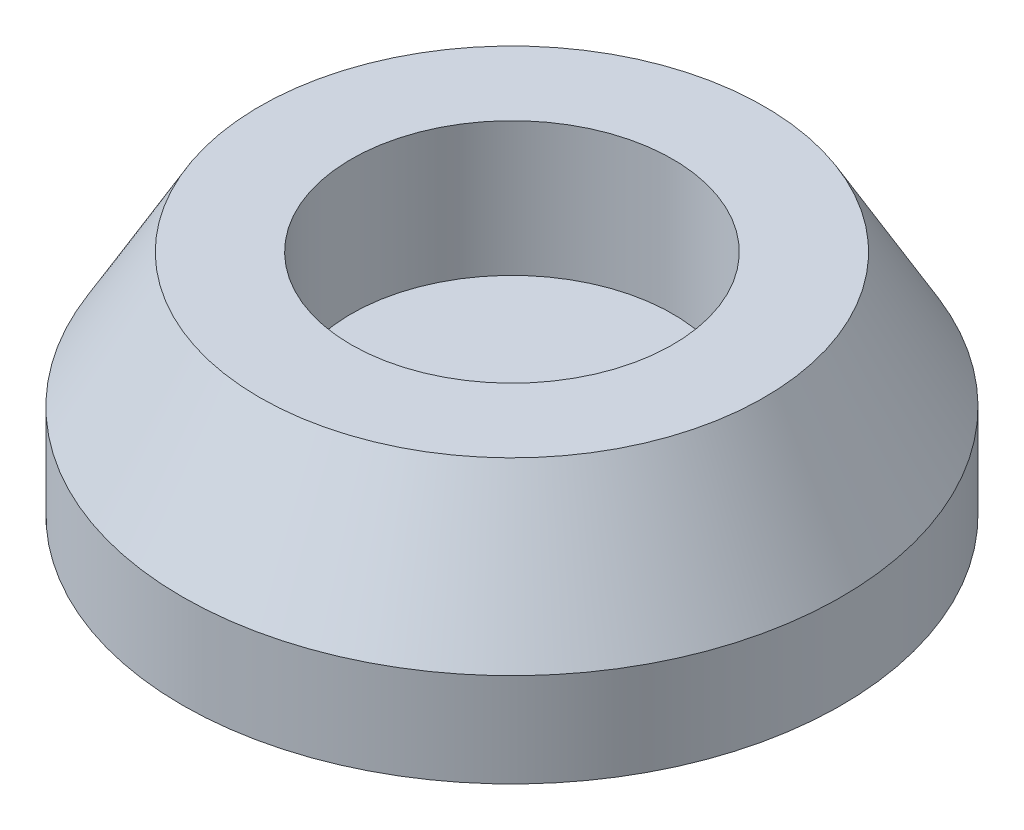
ISO-10303-21;
HEADER;
FILE_DESCRIPTION(('STEP AP214'),'2;1');
FILE_NAME('part.step','',(''),(''),'','','');
FILE_SCHEMA(('AUTOMOTIVE_DESIGN { 1 0 10303 214 1 1 1 1 }'));
ENDSEC;
DATA;
#1=APPLICATION_CONTEXT('core data for automotive mechanical design processes');
#2=APPLICATION_PROTOCOL_DEFINITION('international standard','automotive_design',2000,#1);
#3=PRODUCT_CONTEXT('',#1,'mechanical');
#4=PRODUCT('Part','Part','',(#3));
#5=PRODUCT_RELATED_PRODUCT_CATEGORY('part','',(#4));
#6=PRODUCT_DEFINITION_FORMATION('','',#4);
#7=PRODUCT_DEFINITION_CONTEXT('part definition',#1,'design');
#8=PRODUCT_DEFINITION('design','',#6,#7);
#9=PRODUCT_DEFINITION_SHAPE('','',#8);
#10=(LENGTH_UNIT() NAMED_UNIT(*) SI_UNIT(.MILLI.,.METRE.));
#11=(NAMED_UNIT(*) PLANE_ANGLE_UNIT() SI_UNIT($,.RADIAN.));
#12=(NAMED_UNIT(*) SI_UNIT($,.STERADIAN.) SOLID_ANGLE_UNIT());
#13=UNCERTAINTY_MEASURE_WITH_UNIT(LENGTH_MEASURE(1.E-05),#10,'distance_accuracy_value','');
#14=(GEOMETRIC_REPRESENTATION_CONTEXT(3) GLOBAL_UNCERTAINTY_ASSIGNED_CONTEXT((#13)) GLOBAL_UNIT_ASSIGNED_CONTEXT((#10,
#11,#12)) REPRESENTATION_CONTEXT('',''));
#15=CARTESIAN_POINT('',(0.,0.,0.));
#16=DIRECTION('',(0.,0.,1.));
#17=DIRECTION('',(1.,0.,0.));
#18=AXIS2_PLACEMENT_3D('',#15,#16,#17);
#19=CARTESIAN_POINT('',(0.,3.5,0.));
#20=DIRECTION('',(0.,-1.,0.));
#21=DIRECTION('',(0.,0.,-1.));
#22=AXIS2_PLACEMENT_3D('',#19,#20,#21);
#23=CYLINDRICAL_SURFACE('',#22,12.3);
#24=CARTESIAN_POINT('',(0.,3.49999999999998,0.));
#25=DIRECTION('',(0.,1.,0.));
#26=DIRECTION('',(0.,0.,1.));
#27=AXIS2_PLACEMENT_3D('',#24,#25,#26);
#28=CIRCLE('',#27,12.3);
#29=CARTESIAN_POINT('',(0.,3.49999999999998,12.3));
#30=VERTEX_POINT('',#29);
#31=EDGE_CURVE('E10',#30,#30,#28,.F.);
#32=ORIENTED_EDGE('',*,*,#31,.T.);
#33=EDGE_LOOP('',(#32));
#34=FACE_BOUND('',#33,.T.);
#35=CARTESIAN_POINT('',(0.,0.,0.));
#36=DIRECTION('',(0.,1.,0.));
#37=DIRECTION('',(0.,0.,1.));
#38=AXIS2_PLACEMENT_3D('',#35,#36,#37);
#39=CIRCLE('',#38,12.3);
#40=CARTESIAN_POINT('',(0.,0.,12.3));
#41=VERTEX_POINT('',#40);
#42=EDGE_CURVE('E49',#41,#41,#39,.T.);
#43=ORIENTED_EDGE('',*,*,#42,.T.);
#44=EDGE_LOOP('',(#43));
#45=FACE_BOUND('',#44,.T.);
#46=ADVANCED_FACE('F33',(#34,#45),#23,.T.);
#47=CARTESIAN_POINT('',(0.,0.,0.));
#48=DIRECTION('',(0.,1.,0.));
#49=DIRECTION('',(0.,0.,1.));
#50=AXIS2_PLACEMENT_3D('',#47,#48,#49);
#51=PLANE('',#50);
#52=ORIENTED_EDGE('',*,*,#42,.F.);
#53=EDGE_LOOP('',(#52));
#54=FACE_BOUND('',#53,.T.);
#55=ADVANCED_FACE('F63',(#54),#51,.F.);
#56=CARTESIAN_POINT('',(0.,8.5,0.));
#57=DIRECTION('',(0.,1.,0.));
#58=DIRECTION('',(0.,0.,1.));
#59=AXIS2_PLACEMENT_3D('',#56,#57,#58);
#60=PLANE('',#59);
#61=CARTESIAN_POINT('',(0.,8.5,0.));
#62=DIRECTION('',(0.,1.,0.));
#63=DIRECTION('',(0.,0.,1.));
#64=AXIS2_PLACEMENT_3D('',#61,#62,#63);
#65=CIRCLE('',#64,9.41324865405187);
#66=CARTESIAN_POINT('',(0.,8.5,9.41324865405187));
#67=VERTEX_POINT('',#66);
#68=EDGE_CURVE('E41',#67,#67,#65,.T.);
#69=ORIENTED_EDGE('',*,*,#68,.T.);
#70=EDGE_LOOP('',(#69));
#71=FACE_BOUND('',#70,.T.);
#72=CARTESIAN_POINT('',(0.,8.5,0.));
#73=DIRECTION('',(0.,1.,0.));
#74=DIRECTION('',(0.,0.,1.));
#75=AXIS2_PLACEMENT_3D('',#72,#73,#74);
#76=CIRCLE('',#75,6.);
#77=CARTESIAN_POINT('',(0.,8.5,6.));
#78=VERTEX_POINT('',#77);
#79=EDGE_CURVE('E54',#78,#78,#76,.T.);
#80=ORIENTED_EDGE('',*,*,#79,.F.);
#81=EDGE_LOOP('',(#80));
#82=FACE_BOUND('',#81,.T.);
#83=ADVANCED_FACE('F61',(#71,#82),#60,.T.);
#84=CARTESIAN_POINT('',(0.,8.5,0.));
#85=DIRECTION('',(0.,-1.,0.));
#86=DIRECTION('',(0.,0.,-1.));
#87=AXIS2_PLACEMENT_3D('',#84,#85,#86);
#88=CYLINDRICAL_SURFACE('',#87,6.);
#89=ORIENTED_EDGE('',*,*,#79,.T.);
#90=EDGE_LOOP('',(#89));
#91=FACE_BOUND('',#90,.T.);
#92=CARTESIAN_POINT('',(0.,3.5,0.));
#93=DIRECTION('',(0.,1.,0.));
#94=DIRECTION('',(0.,0.,1.));
#95=AXIS2_PLACEMENT_3D('',#92,#93,#94);
#96=CIRCLE('',#95,6.);
#97=CARTESIAN_POINT('',(0.,3.5,6.));
#98=VERTEX_POINT('',#97);
#99=EDGE_CURVE('E45',#98,#98,#96,.F.);
#100=ORIENTED_EDGE('',*,*,#99,.T.);
#101=EDGE_LOOP('',(#100));
#102=FACE_BOUND('',#101,.T.);
#103=ADVANCED_FACE('F58',(#91,#102),#88,.F.);
#104=CARTESIAN_POINT('',(0.,3.5,0.));
#105=DIRECTION('',(0.,1.,0.));
#106=DIRECTION('',(0.,0.,1.));
#107=AXIS2_PLACEMENT_3D('',#104,#105,#106);
#108=PLANE('',#107);
#109=ORIENTED_EDGE('',*,*,#99,.F.);
#110=EDGE_LOOP('',(#109));
#111=FACE_BOUND('',#110,.T.);
#112=ADVANCED_FACE('F69',(#111),#108,.T.);
#113=CARTESIAN_POINT('',(0.,8.5,0.));
#114=DIRECTION('',(0.,-1.,0.));
#115=DIRECTION('',(0.,0.,-1.));
#116=AXIS2_PLACEMENT_3D('',#113,#114,#115);
#117=CONICAL_SURFACE('',#116,9.41324865405187,0.523598775598297);
#118=ORIENTED_EDGE('',*,*,#31,.F.);
#119=EDGE_LOOP('',(#118));
#120=FACE_BOUND('',#119,.T.);
#121=ORIENTED_EDGE('',*,*,#68,.F.);
#122=EDGE_LOOP('',(#121));
#123=FACE_BOUND('',#122,.T.);
#124=ADVANCED_FACE('F36',(#120,#123),#117,.T.);
#125=CLOSED_SHELL('',(#46,#55,#83,#103,#112,#124));
#126=MANIFOLD_SOLID_BREP('B2',#125);
#127=ADVANCED_BREP_SHAPE_REPRESENTATION('',(#18,#126),#14);
#128=SHAPE_DEFINITION_REPRESENTATION(#9,#127);
ENDSEC;
END-ISO-10303-21;
